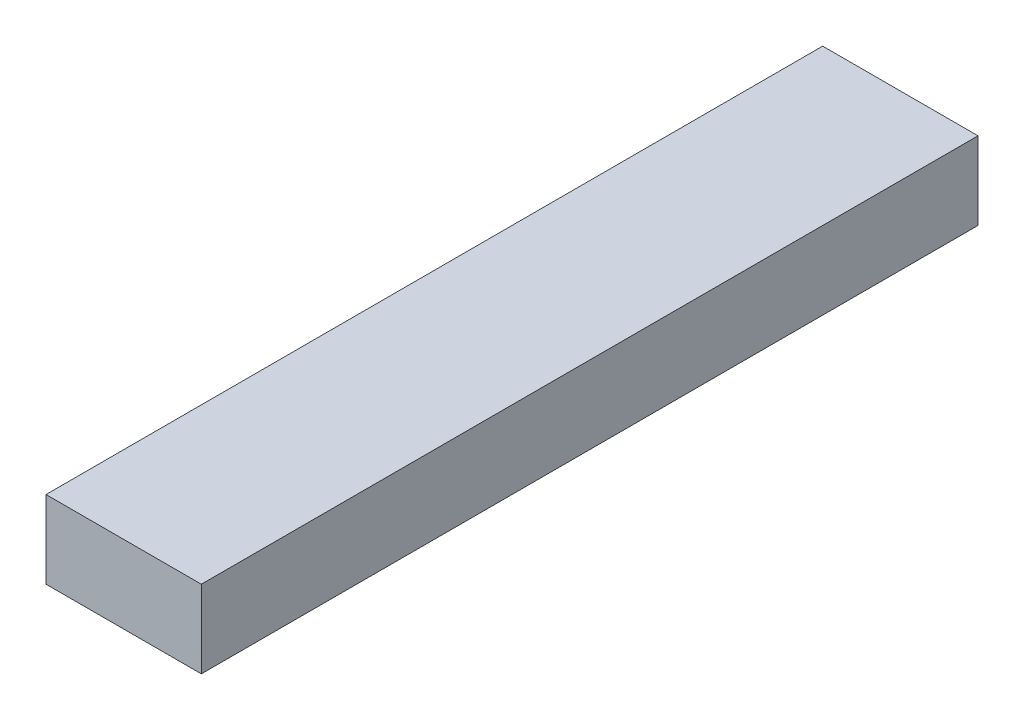
ISO-10303-21;
HEADER;
FILE_DESCRIPTION(('STEP AP214'),'2;1');
FILE_NAME('part.step','',(''),(''),'','','');
FILE_SCHEMA(('AUTOMOTIVE_DESIGN { 1 0 10303 214 1 1 1 1 }'));
ENDSEC;
DATA;
#1=APPLICATION_CONTEXT('core data for automotive mechanical design processes');
#2=APPLICATION_PROTOCOL_DEFINITION('international standard','automotive_design',2000,#1);
#3=PRODUCT_CONTEXT('',#1,'mechanical');
#4=PRODUCT('Part','Part','',(#3));
#5=PRODUCT_RELATED_PRODUCT_CATEGORY('part','',(#4));
#6=PRODUCT_DEFINITION_FORMATION('','',#4);
#7=PRODUCT_DEFINITION_CONTEXT('part definition',#1,'design');
#8=PRODUCT_DEFINITION('design','',#6,#7);
#9=PRODUCT_DEFINITION_SHAPE('','',#8);
#10=(LENGTH_UNIT() NAMED_UNIT(*) SI_UNIT(.MILLI.,.METRE.));
#11=(NAMED_UNIT(*) PLANE_ANGLE_UNIT() SI_UNIT($,.RADIAN.));
#12=(NAMED_UNIT(*) SI_UNIT($,.STERADIAN.) SOLID_ANGLE_UNIT());
#13=UNCERTAINTY_MEASURE_WITH_UNIT(LENGTH_MEASURE(1.E-05),#10,'distance_accuracy_value','');
#14=(GEOMETRIC_REPRESENTATION_CONTEXT(3) GLOBAL_UNCERTAINTY_ASSIGNED_CONTEXT((#13)) GLOBAL_UNIT_ASSIGNED_CONTEXT((#10,
#11,#12)) REPRESENTATION_CONTEXT('',''));
#15=CARTESIAN_POINT('',(0.,0.,0.));
#16=DIRECTION('',(0.,0.,1.));
#17=DIRECTION('',(1.,0.,0.));
#18=AXIS2_PLACEMENT_3D('',#15,#16,#17);
#19=CARTESIAN_POINT('',(-10.,10.,-50.));
#20=DIRECTION('',(1.,0.,0.));
#21=DIRECTION('',(0.,0.,-1.));
#22=AXIS2_PLACEMENT_3D('',#19,#20,#21);
#23=PLANE('',#22);
#24=DIRECTION('',(0.,0.,1.));
#25=VECTOR('',#24,1.);
#26=CARTESIAN_POINT('',(-10.,0.,-50.));
#27=LINE('',#26,#25);
#28=CARTESIAN_POINT('',(-10.,0.,-50.));
#29=VERTEX_POINT('',#28);
#30=CARTESIAN_POINT('',(-10.,0.,50.));
#31=VERTEX_POINT('',#30);
#32=EDGE_CURVE('E96',#29,#31,#27,.T.);
#33=ORIENTED_EDGE('',*,*,#32,.T.);
#34=DIRECTION('',(0.,-1.,0.));
#35=VECTOR('',#34,1.);
#36=CARTESIAN_POINT('',(-10.,10.,50.));
#37=LINE('',#36,#35);
#38=CARTESIAN_POINT('',(-10.,10.,50.));
#39=VERTEX_POINT('',#38);
#40=EDGE_CURVE('E11',#39,#31,#37,.T.);
#41=ORIENTED_EDGE('',*,*,#40,.F.);
#42=DIRECTION('',(0.,0.,1.));
#43=VECTOR('',#42,1.);
#44=CARTESIAN_POINT('',(-10.,10.,-50.));
#45=LINE('',#44,#43);
#46=CARTESIAN_POINT('',(-10.,10.,-50.));
#47=VERTEX_POINT('',#46);
#48=EDGE_CURVE('E84',#47,#39,#45,.T.);
#49=ORIENTED_EDGE('',*,*,#48,.F.);
#50=DIRECTION('',(0.,-1.,0.));
#51=VECTOR('',#50,1.);
#52=CARTESIAN_POINT('',(-10.,10.,-50.));
#53=LINE('',#52,#51);
#54=EDGE_CURVE('E92',#47,#29,#53,.T.);
#55=ORIENTED_EDGE('',*,*,#54,.T.);
#56=EDGE_LOOP('',(#33,#41,#49,#55));
#57=FACE_BOUND('',#56,.T.);
#58=ADVANCED_FACE('F33',(#57),#23,.F.);
#59=CARTESIAN_POINT('',(-10.,10.,50.));
#60=DIRECTION('',(0.,0.,-1.));
#61=DIRECTION('',(-1.,0.,0.));
#62=AXIS2_PLACEMENT_3D('',#59,#60,#61);
#63=PLANE('',#62);
#64=DIRECTION('',(1.,0.,0.));
#65=VECTOR('',#64,1.);
#66=CARTESIAN_POINT('',(-10.,0.,50.));
#67=LINE('',#66,#65);
#68=CARTESIAN_POINT('',(10.,0.,50.));
#69=VERTEX_POINT('',#68);
#70=EDGE_CURVE('E88',#31,#69,#67,.T.);
#71=ORIENTED_EDGE('',*,*,#70,.T.);
#72=DIRECTION('',(0.,-1.,0.));
#73=VECTOR('',#72,1.);
#74=CARTESIAN_POINT('',(10.,10.,50.));
#75=LINE('',#74,#73);
#76=CARTESIAN_POINT('',(10.,10.,50.));
#77=VERTEX_POINT('',#76);
#78=EDGE_CURVE('E41',#77,#69,#75,.T.);
#79=ORIENTED_EDGE('',*,*,#78,.F.);
#80=DIRECTION('',(1.,0.,0.));
#81=VECTOR('',#80,1.);
#82=CARTESIAN_POINT('',(-10.,10.,50.));
#83=LINE('',#82,#81);
#84=EDGE_CURVE('E79',#39,#77,#83,.T.);
#85=ORIENTED_EDGE('',*,*,#84,.F.);
#86=ORIENTED_EDGE('',*,*,#40,.T.);
#87=EDGE_LOOP('',(#71,#79,#85,#86));
#88=FACE_BOUND('',#87,.T.);
#89=ADVANCED_FACE('F87',(#88),#63,.F.);
#90=CARTESIAN_POINT('',(10.,10.,-50.));
#91=DIRECTION('',(-1.,0.,0.));
#92=DIRECTION('',(0.,0.,1.));
#93=AXIS2_PLACEMENT_3D('',#90,#91,#92);
#94=PLANE('',#93);
#95=DIRECTION('',(0.,0.,-1.));
#96=VECTOR('',#95,1.);
#97=CARTESIAN_POINT('',(10.,0.,-50.));
#98=LINE('',#97,#96);
#99=CARTESIAN_POINT('',(10.,0.,-50.));
#100=VERTEX_POINT('',#99);
#101=EDGE_CURVE('E66',#69,#100,#98,.T.);
#102=ORIENTED_EDGE('',*,*,#101,.T.);
#103=DIRECTION('',(0.,-1.,0.));
#104=VECTOR('',#103,1.);
#105=CARTESIAN_POINT('',(10.,10.,-50.));
#106=LINE('',#105,#104);
#107=CARTESIAN_POINT('',(10.,10.,-50.));
#108=VERTEX_POINT('',#107);
#109=EDGE_CURVE('E89',#108,#100,#106,.T.);
#110=ORIENTED_EDGE('',*,*,#109,.F.);
#111=DIRECTION('',(0.,0.,-1.));
#112=VECTOR('',#111,1.);
#113=CARTESIAN_POINT('',(10.,10.,-50.));
#114=LINE('',#113,#112);
#115=EDGE_CURVE('E82',#77,#108,#114,.T.);
#116=ORIENTED_EDGE('',*,*,#115,.F.);
#117=ORIENTED_EDGE('',*,*,#78,.T.);
#118=EDGE_LOOP('',(#102,#110,#116,#117));
#119=FACE_BOUND('',#118,.T.);
#120=ADVANCED_FACE('F90',(#119),#94,.F.);
#121=CARTESIAN_POINT('',(-10.,10.,-50.));
#122=DIRECTION('',(0.,0.,1.));
#123=DIRECTION('',(1.,0.,0.));
#124=AXIS2_PLACEMENT_3D('',#121,#122,#123);
#125=PLANE('',#124);
#126=DIRECTION('',(-1.,0.,0.));
#127=VECTOR('',#126,1.);
#128=CARTESIAN_POINT('',(-10.,0.,-50.));
#129=LINE('',#128,#127);
#130=EDGE_CURVE('E72',#100,#29,#129,.T.);
#131=ORIENTED_EDGE('',*,*,#130,.T.);
#132=ORIENTED_EDGE('',*,*,#54,.F.);
#133=DIRECTION('',(-1.,0.,0.));
#134=VECTOR('',#133,1.);
#135=CARTESIAN_POINT('',(-10.,10.,-50.));
#136=LINE('',#135,#134);
#137=EDGE_CURVE('E49',#108,#47,#136,.T.);
#138=ORIENTED_EDGE('',*,*,#137,.F.);
#139=ORIENTED_EDGE('',*,*,#109,.T.);
#140=EDGE_LOOP('',(#131,#132,#138,#139));
#141=FACE_BOUND('',#140,.T.);
#142=ADVANCED_FACE('F103',(#141),#125,.F.);
#143=CARTESIAN_POINT('',(0.,10.,0.));
#144=DIRECTION('',(0.,1.,0.));
#145=DIRECTION('',(0.,0.,1.));
#146=AXIS2_PLACEMENT_3D('',#143,#144,#145);
#147=PLANE('',#146);
#148=ORIENTED_EDGE('',*,*,#48,.T.);
#149=ORIENTED_EDGE('',*,*,#84,.T.);
#150=ORIENTED_EDGE('',*,*,#115,.T.);
#151=ORIENTED_EDGE('',*,*,#137,.T.);
#152=EDGE_LOOP('',(#148,#149,#150,#151));
#153=FACE_BOUND('',#152,.T.);
#154=ADVANCED_FACE('F80',(#153),#147,.T.);
#155=CARTESIAN_POINT('',(0.,0.,0.));
#156=DIRECTION('',(0.,1.,0.));
#157=DIRECTION('',(0.,0.,1.));
#158=AXIS2_PLACEMENT_3D('',#155,#156,#157);
#159=PLANE('',#158);
#160=ORIENTED_EDGE('',*,*,#32,.F.);
#161=ORIENTED_EDGE('',*,*,#130,.F.);
#162=ORIENTED_EDGE('',*,*,#101,.F.);
#163=ORIENTED_EDGE('',*,*,#70,.F.);
#164=EDGE_LOOP('',(#160,#161,#162,#163));
#165=FACE_BOUND('',#164,.T.);
#166=ADVANCED_FACE('F106',(#165),#159,.F.);
#167=CLOSED_SHELL('',(#58,#89,#120,#142,#154,#166));
#168=MANIFOLD_SOLID_BREP('B2',#167);
#169=ADVANCED_BREP_SHAPE_REPRESENTATION('',(#18,#168),#14);
#170=SHAPE_DEFINITION_REPRESENTATION(#9,#169);
ENDSEC;
END-ISO-10303-21;
